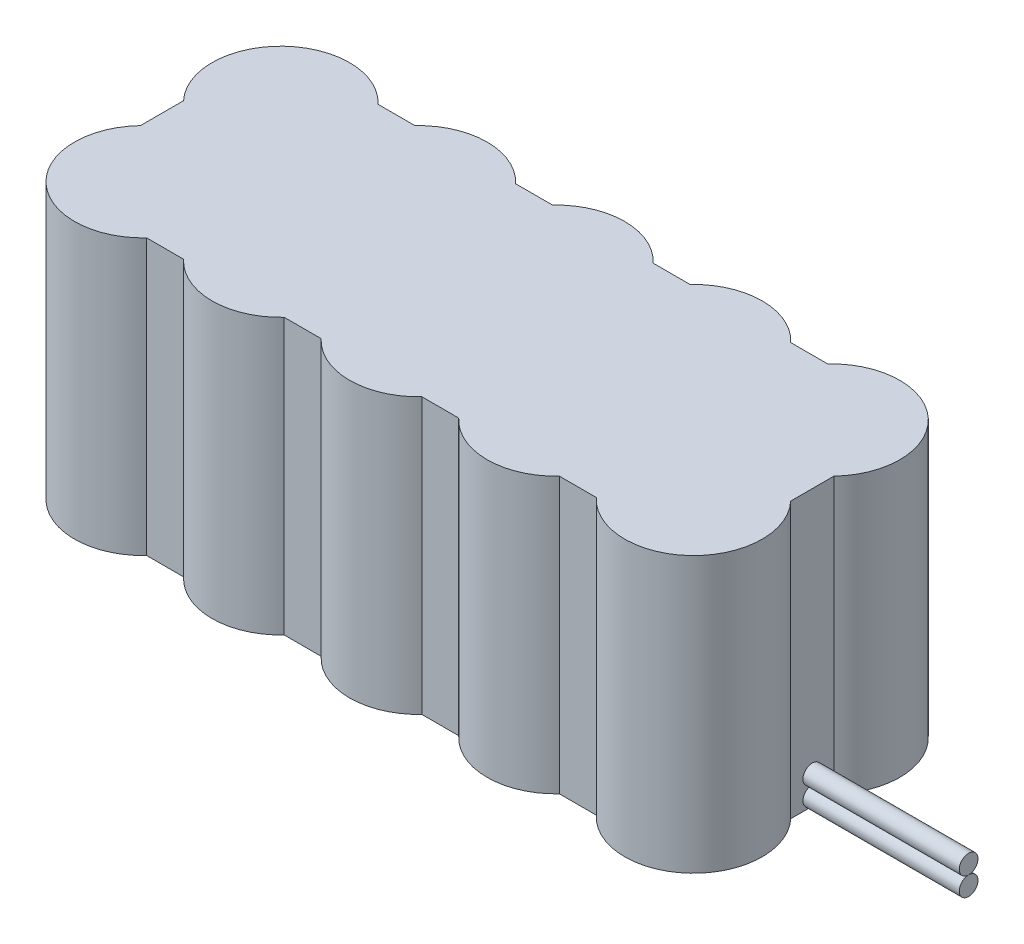
ISO-10303-21;
HEADER;
FILE_DESCRIPTION(('STEP AP214'),'2;1');
FILE_NAME('part.step','',(''),(''),'','','');
FILE_SCHEMA(('AUTOMOTIVE_DESIGN { 1 0 10303 214 1 1 1 1 }'));
ENDSEC;
DATA;
#1=APPLICATION_CONTEXT('core data for automotive mechanical design processes');
#2=APPLICATION_PROTOCOL_DEFINITION('international standard','automotive_design',2000,#1);
#3=PRODUCT_CONTEXT('',#1,'mechanical');
#4=PRODUCT('Part','Part','',(#3));
#5=PRODUCT_RELATED_PRODUCT_CATEGORY('part','',(#4));
#6=PRODUCT_DEFINITION_FORMATION('','',#4);
#7=PRODUCT_DEFINITION_CONTEXT('part definition',#1,'design');
#8=PRODUCT_DEFINITION('design','',#6,#7);
#9=PRODUCT_DEFINITION_SHAPE('','',#8);
#10=(LENGTH_UNIT() NAMED_UNIT(*) SI_UNIT(.MILLI.,.METRE.));
#11=(NAMED_UNIT(*) PLANE_ANGLE_UNIT() SI_UNIT($,.RADIAN.));
#12=(NAMED_UNIT(*) SI_UNIT($,.STERADIAN.) SOLID_ANGLE_UNIT());
#13=UNCERTAINTY_MEASURE_WITH_UNIT(LENGTH_MEASURE(1.E-05),#10,'distance_accuracy_value','');
#14=(GEOMETRIC_REPRESENTATION_CONTEXT(3) GLOBAL_UNCERTAINTY_ASSIGNED_CONTEXT((#13)) GLOBAL_UNIT_ASSIGNED_CONTEXT((#10,
#11,#12)) REPRESENTATION_CONTEXT('',''));
#15=CARTESIAN_POINT('',(0.,0.,0.));
#16=DIRECTION('',(0.,0.,1.));
#17=DIRECTION('',(1.,0.,0.));
#18=AXIS2_PLACEMENT_3D('',#15,#16,#17);
#19=CARTESIAN_POINT('',(96.,4.5,0.));
#20=DIRECTION('',(1.,0.,0.));
#21=DIRECTION('',(0.,0.,-1.));
#22=AXIS2_PLACEMENT_3D('',#19,#20,#21);
#23=CYLINDRICAL_SURFACE('',#22,1.5);
#24=CARTESIAN_POINT('',(121.,4.5,0.));
#25=DIRECTION('',(1.,0.,0.));
#26=DIRECTION('',(0.,0.,-1.));
#27=AXIS2_PLACEMENT_3D('',#24,#25,#26);
#28=CIRCLE('',#27,1.5);
#29=CARTESIAN_POINT('',(121.,4.5,-1.5));
#30=VERTEX_POINT('',#29);
#31=EDGE_CURVE('E100',#30,#30,#28,.F.);
#32=ORIENTED_EDGE('',*,*,#31,.T.);
#33=EDGE_LOOP('',(#32));
#34=FACE_BOUND('',#33,.T.);
#35=CARTESIAN_POINT('',(96.,4.5,0.));
#36=DIRECTION('',(1.,0.,0.));
#37=DIRECTION('',(0.,0.,-1.));
#38=AXIS2_PLACEMENT_3D('',#35,#36,#37);
#39=CIRCLE('',#38,1.5);
#40=CARTESIAN_POINT('',(96.,3.,0.));
#41=VERTEX_POINT('',#40);
#42=EDGE_CURVE('E47',#41,#41,#39,.T.);
#43=ORIENTED_EDGE('',*,*,#42,.T.);
#44=EDGE_LOOP('',(#43));
#45=FACE_BOUND('',#44,.T.);
#46=ADVANCED_FACE('F15',(#34,#45),#23,.T.);
#47=CARTESIAN_POINT('',(121.,0.,0.));
#48=DIRECTION('',(1.,0.,0.));
#49=DIRECTION('',(0.,0.,-1.));
#50=AXIS2_PLACEMENT_3D('',#47,#48,#49);
#51=PLANE('',#50);
#52=ORIENTED_EDGE('',*,*,#31,.F.);
#53=EDGE_LOOP('',(#52));
#54=FACE_BOUND('',#53,.T.);
#55=ADVANCED_FACE('F17',(#54),#51,.T.);
#56=CARTESIAN_POINT('',(96.,1.5,0.));
#57=DIRECTION('',(1.,0.,0.));
#58=DIRECTION('',(0.,0.,-1.));
#59=AXIS2_PLACEMENT_3D('',#56,#57,#58);
#60=CYLINDRICAL_SURFACE('',#59,1.5);
#61=CARTESIAN_POINT('',(121.,1.5,0.));
#62=DIRECTION('',(1.,0.,0.));
#63=DIRECTION('',(0.,0.,-1.));
#64=AXIS2_PLACEMENT_3D('',#61,#62,#63);
#65=CIRCLE('',#64,1.5);
#66=CARTESIAN_POINT('',(121.,1.5,-1.5));
#67=VERTEX_POINT('',#66);
#68=EDGE_CURVE('E95',#67,#67,#65,.F.);
#69=ORIENTED_EDGE('',*,*,#68,.T.);
#70=EDGE_LOOP('',(#69));
#71=FACE_BOUND('',#70,.T.);
#72=CARTESIAN_POINT('',(96.,1.5,0.));
#73=DIRECTION('',(1.,0.,0.));
#74=DIRECTION('',(0.,0.,-1.));
#75=AXIS2_PLACEMENT_3D('',#72,#73,#74);
#76=CIRCLE('',#75,1.5);
#77=CARTESIAN_POINT('',(96.,0.,0.));
#78=VERTEX_POINT('',#77);
#79=EDGE_CURVE('E53',#41,#78,#76,.T.);
#80=ORIENTED_EDGE('',*,*,#79,.T.);
#81=CARTESIAN_POINT('',(96.,1.5,0.));
#82=DIRECTION('',(1.,0.,0.));
#83=DIRECTION('',(0.,0.,-1.));
#84=AXIS2_PLACEMENT_3D('',#81,#82,#83);
#85=CIRCLE('',#84,1.5);
#86=EDGE_CURVE('E57',#78,#41,#85,.T.);
#87=ORIENTED_EDGE('',*,*,#86,.T.);
#88=EDGE_LOOP('',(#80,#87));
#89=FACE_BOUND('',#88,.T.);
#90=ADVANCED_FACE('F55',(#71,#89),#60,.T.);
#91=CARTESIAN_POINT('',(121.,0.,0.));
#92=DIRECTION('',(1.,0.,0.));
#93=DIRECTION('',(0.,0.,-1.));
#94=AXIS2_PLACEMENT_3D('',#91,#92,#93);
#95=PLANE('',#94);
#96=ORIENTED_EDGE('',*,*,#68,.F.);
#97=EDGE_LOOP('',(#96));
#98=FACE_BOUND('',#97,.T.);
#99=ADVANCED_FACE('F119',(#98),#95,.T.);
#100=CARTESIAN_POINT('',(0.,44.,0.));
#101=DIRECTION('',(0.,1.,0.));
#102=DIRECTION('',(0.,0.,1.));
#103=AXIS2_PLACEMENT_3D('',#100,#101,#102);
#104=PLANE('',#103);
#105=CARTESIAN_POINT('',(88.,44.,-11.));
#106=DIRECTION('',(0.,1.,0.));
#107=DIRECTION('',(0.,0.,1.));
#108=AXIS2_PLACEMENT_3D('',#105,#106,#107);
#109=CIRCLE('',#108,11.);
#110=CARTESIAN_POINT('',(96.,44.,-3.45016556472917));
#111=VERTEX_POINT('',#110);
#112=CARTESIAN_POINT('',(79.9532615302822,44.,-18.5));
#113=VERTEX_POINT('',#112);
#114=EDGE_CURVE('E88',#111,#113,#109,.T.);
#115=ORIENTED_EDGE('',*,*,#114,.T.);
#116=DIRECTION('',(1.,0.,0.));
#117=VECTOR('',#116,1.);
#118=CARTESIAN_POINT('',(0.,44.,-18.5));
#119=LINE('',#118,#117);
#120=CARTESIAN_POINT('',(74.0467384697178,44.,-18.5));
#121=VERTEX_POINT('',#120);
#122=EDGE_CURVE('E94',#113,#121,#119,.F.);
#123=ORIENTED_EDGE('',*,*,#122,.T.);
#124=CARTESIAN_POINT('',(66.,44.,-11.));
#125=DIRECTION('',(0.,1.,0.));
#126=DIRECTION('',(0.,0.,1.));
#127=AXIS2_PLACEMENT_3D('',#124,#125,#126);
#128=CIRCLE('',#127,11.);
#129=CARTESIAN_POINT('',(57.9532615302822,44.,-18.5));
#130=VERTEX_POINT('',#129);
#131=EDGE_CURVE('E97',#121,#130,#128,.T.);
#132=ORIENTED_EDGE('',*,*,#131,.T.);
#133=DIRECTION('',(1.,0.,0.));
#134=VECTOR('',#133,1.);
#135=CARTESIAN_POINT('',(0.,44.,-18.5));
#136=LINE('',#135,#134);
#137=CARTESIAN_POINT('',(52.0467384697166,44.,-18.4999999999989));
#138=VERTEX_POINT('',#137);
#139=EDGE_CURVE('E326',#130,#138,#136,.F.);
#140=ORIENTED_EDGE('',*,*,#139,.T.);
#141=CARTESIAN_POINT('',(44.,44.,-11.));
#142=DIRECTION('',(0.,1.,0.));
#143=DIRECTION('',(0.,0.,1.));
#144=AXIS2_PLACEMENT_3D('',#141,#142,#143);
#145=CIRCLE('',#144,11.);
#146=CARTESIAN_POINT('',(35.9532615302822,44.,-18.5));
#147=VERTEX_POINT('',#146);
#148=EDGE_CURVE('E464',#138,#147,#145,.T.);
#149=ORIENTED_EDGE('',*,*,#148,.T.);
#150=DIRECTION('',(1.,0.,0.));
#151=VECTOR('',#150,1.);
#152=CARTESIAN_POINT('',(0.,44.,-18.5));
#153=LINE('',#152,#151);
#154=CARTESIAN_POINT('',(30.0467384697166,44.,-18.4999999999989));
#155=VERTEX_POINT('',#154);
#156=EDGE_CURVE('E461',#147,#155,#153,.F.);
#157=ORIENTED_EDGE('',*,*,#156,.T.);
#158=CARTESIAN_POINT('',(22.,44.,-11.));
#159=DIRECTION('',(0.,1.,0.));
#160=DIRECTION('',(0.,0.,1.));
#161=AXIS2_PLACEMENT_3D('',#158,#159,#160);
#162=CIRCLE('',#161,11.);
#163=CARTESIAN_POINT('',(13.9532615302822,44.,-18.5));
#164=VERTEX_POINT('',#163);
#165=EDGE_CURVE('E458',#155,#164,#162,.T.);
#166=ORIENTED_EDGE('',*,*,#165,.T.);
#167=DIRECTION('',(1.,0.,0.));
#168=VECTOR('',#167,1.);
#169=CARTESIAN_POINT('',(0.,44.,-18.5));
#170=LINE('',#169,#168);
#171=CARTESIAN_POINT('',(8.04673846971565,44.,-18.4999999999999));
#172=VERTEX_POINT('',#171);
#173=EDGE_CURVE('E455',#164,#172,#170,.F.);
#174=ORIENTED_EDGE('',*,*,#173,.T.);
#175=CARTESIAN_POINT('',(0.,44.,-11.));
#176=DIRECTION('',(0.,1.,0.));
#177=DIRECTION('',(0.,0.,1.));
#178=AXIS2_PLACEMENT_3D('',#175,#176,#177);
#179=CIRCLE('',#178,11.);
#180=CARTESIAN_POINT('',(-8.,44.,-3.45016556472913));
#181=VERTEX_POINT('',#180);
#182=EDGE_CURVE('E452',#172,#181,#179,.T.);
#183=ORIENTED_EDGE('',*,*,#182,.T.);
#184=DIRECTION('',(0.,0.,1.));
#185=VECTOR('',#184,1.);
#186=CARTESIAN_POINT('',(-8.,44.,0.));
#187=LINE('',#186,#185);
#188=CARTESIAN_POINT('',(-7.99999999999994,44.,3.45016556472918));
#189=VERTEX_POINT('',#188);
#190=EDGE_CURVE('E449',#181,#189,#187,.T.);
#191=ORIENTED_EDGE('',*,*,#190,.T.);
#192=CARTESIAN_POINT('',(0.,44.,11.));
#193=DIRECTION('',(0.,1.,0.));
#194=DIRECTION('',(0.,0.,1.));
#195=AXIS2_PLACEMENT_3D('',#192,#193,#194);
#196=CIRCLE('',#195,11.);
#197=CARTESIAN_POINT('',(8.04673846971577,44.,18.5));
#198=VERTEX_POINT('',#197);
#199=EDGE_CURVE('E446',#189,#198,#196,.T.);
#200=ORIENTED_EDGE('',*,*,#199,.T.);
#201=DIRECTION('',(1.,0.,0.));
#202=VECTOR('',#201,1.);
#203=CARTESIAN_POINT('',(0.,44.,18.5));
#204=LINE('',#203,#202);
#205=CARTESIAN_POINT('',(13.9532615302834,44.,18.4999999999989));
#206=VERTEX_POINT('',#205);
#207=EDGE_CURVE('E443',#198,#206,#204,.T.);
#208=ORIENTED_EDGE('',*,*,#207,.T.);
#209=CARTESIAN_POINT('',(22.,44.,11.));
#210=DIRECTION('',(0.,1.,0.));
#211=DIRECTION('',(0.,0.,1.));
#212=AXIS2_PLACEMENT_3D('',#209,#210,#211);
#213=CIRCLE('',#212,11.);
#214=CARTESIAN_POINT('',(30.0467384697178,44.,18.5));
#215=VERTEX_POINT('',#214);
#216=EDGE_CURVE('E440',#206,#215,#213,.T.);
#217=ORIENTED_EDGE('',*,*,#216,.T.);
#218=DIRECTION('',(1.,0.,0.));
#219=VECTOR('',#218,1.);
#220=CARTESIAN_POINT('',(0.,44.,18.5));
#221=LINE('',#220,#219);
#222=CARTESIAN_POINT('',(35.9532615302834,44.,18.4999999999989));
#223=VERTEX_POINT('',#222);
#224=EDGE_CURVE('E437',#215,#223,#221,.T.);
#225=ORIENTED_EDGE('',*,*,#224,.T.);
#226=CARTESIAN_POINT('',(44.,44.,11.));
#227=DIRECTION('',(0.,1.,0.));
#228=DIRECTION('',(0.,0.,1.));
#229=AXIS2_PLACEMENT_3D('',#226,#227,#228);
#230=CIRCLE('',#229,11.);
#231=CARTESIAN_POINT('',(52.0467384697178,44.,18.5));
#232=VERTEX_POINT('',#231);
#233=EDGE_CURVE('E434',#223,#232,#230,.T.);
#234=ORIENTED_EDGE('',*,*,#233,.T.);
#235=DIRECTION('',(1.,0.,0.));
#236=VECTOR('',#235,1.);
#237=CARTESIAN_POINT('',(0.,44.,18.5));
#238=LINE('',#237,#236);
#239=CARTESIAN_POINT('',(57.9532615302834,44.,18.4999999999989));
#240=VERTEX_POINT('',#239);
#241=EDGE_CURVE('E431',#232,#240,#238,.T.);
#242=ORIENTED_EDGE('',*,*,#241,.T.);
#243=CARTESIAN_POINT('',(66.,44.,11.));
#244=DIRECTION('',(0.,1.,0.));
#245=DIRECTION('',(0.,0.,1.));
#246=AXIS2_PLACEMENT_3D('',#243,#244,#245);
#247=CIRCLE('',#246,11.);
#248=CARTESIAN_POINT('',(74.0467384697178,44.,18.5));
#249=VERTEX_POINT('',#248);
#250=EDGE_CURVE('E428',#240,#249,#247,.T.);
#251=ORIENTED_EDGE('',*,*,#250,.T.);
#252=DIRECTION('',(1.,0.,0.));
#253=VECTOR('',#252,1.);
#254=CARTESIAN_POINT('',(0.,44.,18.5));
#255=LINE('',#254,#253);
#256=CARTESIAN_POINT('',(79.9532615302834,44.,18.4999999999989));
#257=VERTEX_POINT('',#256);
#258=EDGE_CURVE('E108',#249,#257,#255,.T.);
#259=ORIENTED_EDGE('',*,*,#258,.T.);
#260=CARTESIAN_POINT('',(88.,44.,11.));
#261=DIRECTION('',(0.,1.,0.));
#262=DIRECTION('',(0.,0.,1.));
#263=AXIS2_PLACEMENT_3D('',#260,#261,#262);
#264=CIRCLE('',#263,11.);
#265=CARTESIAN_POINT('',(96.,43.9999998333333,3.45016556472917));
#266=VERTEX_POINT('',#265);
#267=EDGE_CURVE('E106',#257,#266,#264,.T.);
#268=ORIENTED_EDGE('',*,*,#267,.T.);
#269=DIRECTION('',(0.,0.,1.));
#270=VECTOR('',#269,1.);
#271=CARTESIAN_POINT('',(96.,44.,0.));
#272=LINE('',#271,#270);
#273=EDGE_CURVE('E9',#111,#266,#272,.T.);
#274=ORIENTED_EDGE('',*,*,#273,.F.);
#275=EDGE_LOOP('',(#115,#123,#132,#140,#149,#157,#166,#174,#183,#191,#200,#208,#217,#225,#234,
#242,#251,#259,#268,#274));
#276=FACE_BOUND('',#275,.T.);
#277=ADVANCED_FACE('F132',(#276),#104,.T.);
#278=CARTESIAN_POINT('',(88.,0.,-11.));
#279=DIRECTION('',(0.,1.,0.));
#280=DIRECTION('',(0.,0.,1.));
#281=AXIS2_PLACEMENT_3D('',#278,#279,#280);
#282=CYLINDRICAL_SURFACE('',#281,11.);
#283=DIRECTION('',(0.,1.,0.));
#284=VECTOR('',#283,1.);
#285=CARTESIAN_POINT('',(96.,22.,-3.45016556472912));
#286=LINE('',#285,#284);
#287=CARTESIAN_POINT('',(96.,0.,-3.45016556472917));
#288=VERTEX_POINT('',#287);
#289=EDGE_CURVE('E25',#288,#111,#286,.T.);
#290=ORIENTED_EDGE('',*,*,#289,.F.);
#291=CARTESIAN_POINT('',(88.,0.,-11.));
#292=DIRECTION('',(0.,1.,0.));
#293=DIRECTION('',(0.,0.,1.));
#294=AXIS2_PLACEMENT_3D('',#291,#292,#293);
#295=CIRCLE('',#294,11.);
#296=CARTESIAN_POINT('',(79.9532615302822,0.,-18.5));
#297=VERTEX_POINT('',#296);
#298=EDGE_CURVE('E71',#288,#297,#295,.T.);
#299=ORIENTED_EDGE('',*,*,#298,.T.);
#300=DIRECTION('',(0.,1.,0.));
#301=VECTOR('',#300,1.);
#302=CARTESIAN_POINT('',(79.95326153028,0.,-18.5));
#303=LINE('',#302,#301);
#304=EDGE_CURVE('E90',#113,#297,#303,.F.);
#305=ORIENTED_EDGE('',*,*,#304,.F.);
#306=ORIENTED_EDGE('',*,*,#114,.F.);
#307=EDGE_LOOP('',(#290,#299,#305,#306));
#308=FACE_BOUND('',#307,.T.);
#309=ADVANCED_FACE('F83',(#308),#282,.T.);
#310=CARTESIAN_POINT('',(88.,0.,11.));
#311=DIRECTION('',(0.,1.,0.));
#312=DIRECTION('',(0.,0.,1.));
#313=AXIS2_PLACEMENT_3D('',#310,#311,#312);
#314=CYLINDRICAL_SURFACE('',#313,11.);
#315=DIRECTION('',(0.,1.,0.));
#316=VECTOR('',#315,1.);
#317=CARTESIAN_POINT('',(79.9532615302824,0.,18.4999999999978));
#318=LINE('',#317,#316);
#319=CARTESIAN_POINT('',(79.9532615302834,0.,18.4999999999989));
#320=VERTEX_POINT('',#319);
#321=EDGE_CURVE('E422',#257,#320,#318,.F.);
#322=ORIENTED_EDGE('',*,*,#321,.T.);
#323=CARTESIAN_POINT('',(88.,0.,11.));
#324=DIRECTION('',(0.,1.,0.));
#325=DIRECTION('',(0.,0.,1.));
#326=AXIS2_PLACEMENT_3D('',#323,#324,#325);
#327=CIRCLE('',#326,11.);
#328=CARTESIAN_POINT('',(96.,0.,3.45016556472917));
#329=VERTEX_POINT('',#328);
#330=EDGE_CURVE('E78',#320,#329,#327,.T.);
#331=ORIENTED_EDGE('',*,*,#330,.T.);
#332=DIRECTION('',(0.,1.,0.));
#333=VECTOR('',#332,1.);
#334=CARTESIAN_POINT('',(96.,22.,3.45016556472912));
#335=LINE('',#334,#333);
#336=EDGE_CURVE('E19',#329,#266,#335,.T.);
#337=ORIENTED_EDGE('',*,*,#336,.T.);
#338=ORIENTED_EDGE('',*,*,#267,.F.);
#339=EDGE_LOOP('',(#322,#331,#337,#338));
#340=FACE_BOUND('',#339,.T.);
#341=ADVANCED_FACE('F137',(#340),#314,.T.);
#342=CARTESIAN_POINT('',(0.,0.,0.));
#343=DIRECTION('',(0.,1.,0.));
#344=DIRECTION('',(0.,0.,1.));
#345=AXIS2_PLACEMENT_3D('',#342,#343,#344);
#346=PLANE('',#345);
#347=DIRECTION('',(1.,0.,0.));
#348=VECTOR('',#347,1.);
#349=CARTESIAN_POINT('',(-8.,0.,18.5));
#350=LINE('',#349,#348);
#351=CARTESIAN_POINT('',(74.0467384697178,0.,18.5));
#352=VERTEX_POINT('',#351);
#353=EDGE_CURVE('E419',#352,#320,#350,.T.);
#354=ORIENTED_EDGE('',*,*,#353,.F.);
#355=CARTESIAN_POINT('',(66.,0.,11.));
#356=DIRECTION('',(0.,1.,0.));
#357=DIRECTION('',(0.,0.,1.));
#358=AXIS2_PLACEMENT_3D('',#355,#356,#357);
#359=CIRCLE('',#358,11.);
#360=CARTESIAN_POINT('',(57.9532615302834,0.,18.4999999999989));
#361=VERTEX_POINT('',#360);
#362=EDGE_CURVE('E416',#361,#352,#359,.T.);
#363=ORIENTED_EDGE('',*,*,#362,.F.);
#364=DIRECTION('',(1.,0.,0.));
#365=VECTOR('',#364,1.);
#366=CARTESIAN_POINT('',(-8.,0.,18.5));
#367=LINE('',#366,#365);
#368=CARTESIAN_POINT('',(52.0467384697178,0.,18.5));
#369=VERTEX_POINT('',#368);
#370=EDGE_CURVE('E413',#369,#361,#367,.T.);
#371=ORIENTED_EDGE('',*,*,#370,.F.);
#372=CARTESIAN_POINT('',(44.,0.,11.));
#373=DIRECTION('',(0.,1.,0.));
#374=DIRECTION('',(0.,0.,1.));
#375=AXIS2_PLACEMENT_3D('',#372,#373,#374);
#376=CIRCLE('',#375,11.);
#377=CARTESIAN_POINT('',(35.9532615302834,0.,18.4999999999989));
#378=VERTEX_POINT('',#377);
#379=EDGE_CURVE('E410',#378,#369,#376,.T.);
#380=ORIENTED_EDGE('',*,*,#379,.F.);
#381=DIRECTION('',(1.,0.,0.));
#382=VECTOR('',#381,1.);
#383=CARTESIAN_POINT('',(-8.,0.,18.5));
#384=LINE('',#383,#382);
#385=CARTESIAN_POINT('',(30.0467384697178,0.,18.5));
#386=VERTEX_POINT('',#385);
#387=EDGE_CURVE('E407',#386,#378,#384,.T.);
#388=ORIENTED_EDGE('',*,*,#387,.F.);
#389=CARTESIAN_POINT('',(22.,0.,11.));
#390=DIRECTION('',(0.,1.,0.));
#391=DIRECTION('',(0.,0.,1.));
#392=AXIS2_PLACEMENT_3D('',#389,#390,#391);
#393=CIRCLE('',#392,11.);
#394=CARTESIAN_POINT('',(13.9532615302834,0.,18.4999999999989));
#395=VERTEX_POINT('',#394);
#396=EDGE_CURVE('E404',#395,#386,#393,.T.);
#397=ORIENTED_EDGE('',*,*,#396,.F.);
#398=DIRECTION('',(1.,0.,0.));
#399=VECTOR('',#398,1.);
#400=CARTESIAN_POINT('',(-8.,0.,18.5));
#401=LINE('',#400,#399);
#402=CARTESIAN_POINT('',(8.04673846971577,0.,18.5));
#403=VERTEX_POINT('',#402);
#404=EDGE_CURVE('E401',#403,#395,#401,.T.);
#405=ORIENTED_EDGE('',*,*,#404,.F.);
#406=CARTESIAN_POINT('',(0.,0.,11.));
#407=DIRECTION('',(0.,1.,0.));
#408=DIRECTION('',(0.,0.,1.));
#409=AXIS2_PLACEMENT_3D('',#406,#407,#408);
#410=CIRCLE('',#409,11.);
#411=CARTESIAN_POINT('',(-7.99999999999994,0.,3.45016556472918));
#412=VERTEX_POINT('',#411);
#413=EDGE_CURVE('E398',#412,#403,#410,.T.);
#414=ORIENTED_EDGE('',*,*,#413,.F.);
#415=DIRECTION('',(0.,0.,1.));
#416=VECTOR('',#415,1.);
#417=CARTESIAN_POINT('',(-8.,0.,-18.5));
#418=LINE('',#417,#416);
#419=CARTESIAN_POINT('',(-8.,0.,-3.45016556472913));
#420=VERTEX_POINT('',#419);
#421=EDGE_CURVE('E395',#420,#412,#418,.T.);
#422=ORIENTED_EDGE('',*,*,#421,.F.);
#423=CARTESIAN_POINT('',(0.,0.,-11.));
#424=DIRECTION('',(0.,1.,0.));
#425=DIRECTION('',(0.,0.,1.));
#426=AXIS2_PLACEMENT_3D('',#423,#424,#425);
#427=CIRCLE('',#426,11.);
#428=CARTESIAN_POINT('',(8.04673846971565,0.,-18.4999999999999));
#429=VERTEX_POINT('',#428);
#430=EDGE_CURVE('E392',#429,#420,#427,.T.);
#431=ORIENTED_EDGE('',*,*,#430,.F.);
#432=DIRECTION('',(-1.,0.,0.));
#433=VECTOR('',#432,1.);
#434=CARTESIAN_POINT('',(96.,0.,-18.5));
#435=LINE('',#434,#433);
#436=CARTESIAN_POINT('',(13.9532615302822,0.,-18.5));
#437=VERTEX_POINT('',#436);
#438=EDGE_CURVE('E389',#437,#429,#435,.T.);
#439=ORIENTED_EDGE('',*,*,#438,.F.);
#440=CARTESIAN_POINT('',(22.,0.,-11.));
#441=DIRECTION('',(0.,1.,0.));
#442=DIRECTION('',(0.,0.,1.));
#443=AXIS2_PLACEMENT_3D('',#440,#441,#442);
#444=CIRCLE('',#443,11.);
#445=CARTESIAN_POINT('',(30.0467384697166,0.,-18.4999999999989));
#446=VERTEX_POINT('',#445);
#447=EDGE_CURVE('E386',#446,#437,#444,.T.);
#448=ORIENTED_EDGE('',*,*,#447,.F.);
#449=DIRECTION('',(-1.,0.,0.));
#450=VECTOR('',#449,1.);
#451=CARTESIAN_POINT('',(96.,0.,-18.5));
#452=LINE('',#451,#450);
#453=CARTESIAN_POINT('',(35.9532615302822,0.,-18.5));
#454=VERTEX_POINT('',#453);
#455=EDGE_CURVE('E383',#454,#446,#452,.T.);
#456=ORIENTED_EDGE('',*,*,#455,.F.);
#457=CARTESIAN_POINT('',(44.,0.,-11.));
#458=DIRECTION('',(0.,1.,0.));
#459=DIRECTION('',(0.,0.,1.));
#460=AXIS2_PLACEMENT_3D('',#457,#458,#459);
#461=CIRCLE('',#460,11.);
#462=CARTESIAN_POINT('',(52.0467384697166,0.,-18.4999999999989));
#463=VERTEX_POINT('',#462);
#464=EDGE_CURVE('E380',#463,#454,#461,.T.);
#465=ORIENTED_EDGE('',*,*,#464,.F.);
#466=DIRECTION('',(-1.,0.,0.));
#467=VECTOR('',#466,1.);
#468=CARTESIAN_POINT('',(96.,0.,-18.5));
#469=LINE('',#468,#467);
#470=CARTESIAN_POINT('',(57.9532615302822,0.,-18.5));
#471=VERTEX_POINT('',#470);
#472=EDGE_CURVE('E378',#471,#463,#469,.T.);
#473=ORIENTED_EDGE('',*,*,#472,.F.);
#474=CARTESIAN_POINT('',(66.,0.,-11.));
#475=DIRECTION('',(0.,1.,0.));
#476=DIRECTION('',(0.,0.,1.));
#477=AXIS2_PLACEMENT_3D('',#474,#475,#476);
#478=CIRCLE('',#477,11.);
#479=CARTESIAN_POINT('',(74.0467384697178,0.,-18.5));
#480=VERTEX_POINT('',#479);
#481=EDGE_CURVE('E376',#480,#471,#478,.T.);
#482=ORIENTED_EDGE('',*,*,#481,.F.);
#483=DIRECTION('',(-1.,0.,0.));
#484=VECTOR('',#483,1.);
#485=CARTESIAN_POINT('',(96.,0.,-18.5));
#486=LINE('',#485,#484);
#487=EDGE_CURVE('E329',#297,#480,#486,.T.);
#488=ORIENTED_EDGE('',*,*,#487,.F.);
#489=ORIENTED_EDGE('',*,*,#298,.F.);
#490=DIRECTION('',(0.,0.,1.));
#491=VECTOR('',#490,1.);
#492=CARTESIAN_POINT('',(96.,0.,-1.7250827823646));
#493=LINE('',#492,#491);
#494=EDGE_CURVE('E65',#288,#78,#493,.T.);
#495=ORIENTED_EDGE('',*,*,#494,.T.);
#496=DIRECTION('',(0.,0.,1.));
#497=VECTOR('',#496,1.);
#498=CARTESIAN_POINT('',(96.,0.,1.7250827823646));
#499=LINE('',#498,#497);
#500=EDGE_CURVE('E60',#78,#329,#499,.T.);
#501=ORIENTED_EDGE('',*,*,#500,.T.);
#502=ORIENTED_EDGE('',*,*,#330,.F.);
#503=EDGE_LOOP('',(#354,#363,#371,#380,#388,#397,#405,#414,#422,#431,#439,#448,#456,#465,#473,
#482,#488,#489,#495,#501,#502));
#504=FACE_BOUND('',#503,.T.);
#505=ADVANCED_FACE('F67',(#504),#346,.F.);
#506=CARTESIAN_POINT('',(-8.,0.,18.5));
#507=DIRECTION('',(0.,0.,1.));
#508=DIRECTION('',(1.,0.,0.));
#509=AXIS2_PLACEMENT_3D('',#506,#507,#508);
#510=PLANE('',#509);
#511=ORIENTED_EDGE('',*,*,#353,.T.);
#512=ORIENTED_EDGE('',*,*,#321,.F.);
#513=ORIENTED_EDGE('',*,*,#258,.F.);
#514=DIRECTION('',(0.,1.,0.));
#515=VECTOR('',#514,1.);
#516=CARTESIAN_POINT('',(74.04673846972,0.,18.5));
#517=LINE('',#516,#515);
#518=EDGE_CURVE('E372',#249,#352,#517,.F.);
#519=ORIENTED_EDGE('',*,*,#518,.T.);
#520=EDGE_LOOP('',(#511,#512,#513,#519));
#521=FACE_BOUND('',#520,.T.);
#522=ADVANCED_FACE('F142',(#521),#510,.T.);
#523=CARTESIAN_POINT('',(66.,0.,11.));
#524=DIRECTION('',(0.,1.,0.));
#525=DIRECTION('',(0.,0.,1.));
#526=AXIS2_PLACEMENT_3D('',#523,#524,#525);
#527=CYLINDRICAL_SURFACE('',#526,11.);
#528=ORIENTED_EDGE('',*,*,#250,.F.);
#529=DIRECTION('',(0.,1.,0.));
#530=VECTOR('',#529,1.);
#531=CARTESIAN_POINT('',(57.9532615302824,0.,18.4999999999978));
#532=LINE('',#531,#530);
#533=EDGE_CURVE('E369',#240,#361,#532,.F.);
#534=ORIENTED_EDGE('',*,*,#533,.T.);
#535=ORIENTED_EDGE('',*,*,#362,.T.);
#536=ORIENTED_EDGE('',*,*,#518,.F.);
#537=EDGE_LOOP('',(#528,#534,#535,#536));
#538=FACE_BOUND('',#537,.T.);
#539=ADVANCED_FACE('F145',(#538),#527,.T.);
#540=CARTESIAN_POINT('',(-8.,0.,18.5));
#541=DIRECTION('',(0.,0.,1.));
#542=DIRECTION('',(1.,0.,0.));
#543=AXIS2_PLACEMENT_3D('',#540,#541,#542);
#544=PLANE('',#543);
#545=ORIENTED_EDGE('',*,*,#370,.T.);
#546=ORIENTED_EDGE('',*,*,#533,.F.);
#547=ORIENTED_EDGE('',*,*,#241,.F.);
#548=DIRECTION('',(0.,1.,0.));
#549=VECTOR('',#548,1.);
#550=CARTESIAN_POINT('',(52.04673846972,0.,18.5));
#551=LINE('',#550,#549);
#552=EDGE_CURVE('E366',#232,#369,#551,.F.);
#553=ORIENTED_EDGE('',*,*,#552,.T.);
#554=EDGE_LOOP('',(#545,#546,#547,#553));
#555=FACE_BOUND('',#554,.T.);
#556=ADVANCED_FACE('F149',(#555),#544,.T.);
#557=CARTESIAN_POINT('',(44.,0.,11.));
#558=DIRECTION('',(0.,1.,0.));
#559=DIRECTION('',(0.,0.,1.));
#560=AXIS2_PLACEMENT_3D('',#557,#558,#559);
#561=CYLINDRICAL_SURFACE('',#560,11.);
#562=ORIENTED_EDGE('',*,*,#233,.F.);
#563=DIRECTION('',(0.,1.,0.));
#564=VECTOR('',#563,1.);
#565=CARTESIAN_POINT('',(35.9532615302824,0.,18.4999999999978));
#566=LINE('',#565,#564);
#567=EDGE_CURVE('E363',#223,#378,#566,.F.);
#568=ORIENTED_EDGE('',*,*,#567,.T.);
#569=ORIENTED_EDGE('',*,*,#379,.T.);
#570=ORIENTED_EDGE('',*,*,#552,.F.);
#571=EDGE_LOOP('',(#562,#568,#569,#570));
#572=FACE_BOUND('',#571,.T.);
#573=ADVANCED_FACE('F153',(#572),#561,.T.);
#574=CARTESIAN_POINT('',(-8.,0.,18.5));
#575=DIRECTION('',(0.,0.,1.));
#576=DIRECTION('',(1.,0.,0.));
#577=AXIS2_PLACEMENT_3D('',#574,#575,#576);
#578=PLANE('',#577);
#579=ORIENTED_EDGE('',*,*,#387,.T.);
#580=ORIENTED_EDGE('',*,*,#567,.F.);
#581=ORIENTED_EDGE('',*,*,#224,.F.);
#582=DIRECTION('',(0.,1.,0.));
#583=VECTOR('',#582,1.);
#584=CARTESIAN_POINT('',(30.04673846972,0.,18.5));
#585=LINE('',#584,#583);
#586=EDGE_CURVE('E360',#215,#386,#585,.F.);
#587=ORIENTED_EDGE('',*,*,#586,.T.);
#588=EDGE_LOOP('',(#579,#580,#581,#587));
#589=FACE_BOUND('',#588,.T.);
#590=ADVANCED_FACE('F157',(#589),#578,.T.);
#591=CARTESIAN_POINT('',(22.,0.,11.));
#592=DIRECTION('',(0.,1.,0.));
#593=DIRECTION('',(0.,0.,1.));
#594=AXIS2_PLACEMENT_3D('',#591,#592,#593);
#595=CYLINDRICAL_SURFACE('',#594,11.);
#596=ORIENTED_EDGE('',*,*,#216,.F.);
#597=DIRECTION('',(0.,1.,0.));
#598=VECTOR('',#597,1.);
#599=CARTESIAN_POINT('',(13.9532615302824,0.,18.4999999999978));
#600=LINE('',#599,#598);
#601=EDGE_CURVE('E357',#206,#395,#600,.F.);
#602=ORIENTED_EDGE('',*,*,#601,.T.);
#603=ORIENTED_EDGE('',*,*,#396,.T.);
#604=ORIENTED_EDGE('',*,*,#586,.F.);
#605=EDGE_LOOP('',(#596,#602,#603,#604));
#606=FACE_BOUND('',#605,.T.);
#607=ADVANCED_FACE('F161',(#606),#595,.T.);
#608=CARTESIAN_POINT('',(-8.,0.,18.5));
#609=DIRECTION('',(0.,0.,1.));
#610=DIRECTION('',(1.,0.,0.));
#611=AXIS2_PLACEMENT_3D('',#608,#609,#610);
#612=PLANE('',#611);
#613=ORIENTED_EDGE('',*,*,#404,.T.);
#614=ORIENTED_EDGE('',*,*,#601,.F.);
#615=ORIENTED_EDGE('',*,*,#207,.F.);
#616=DIRECTION('',(0.,1.,0.));
#617=VECTOR('',#616,1.);
#618=CARTESIAN_POINT('',(8.046738469716,0.,18.5));
#619=LINE('',#618,#617);
#620=EDGE_CURVE('E354',#198,#403,#619,.F.);
#621=ORIENTED_EDGE('',*,*,#620,.T.);
#622=EDGE_LOOP('',(#613,#614,#615,#621));
#623=FACE_BOUND('',#622,.T.);
#624=ADVANCED_FACE('F165',(#623),#612,.T.);
#625=CARTESIAN_POINT('',(0.,0.,11.));
#626=DIRECTION('',(0.,1.,0.));
#627=DIRECTION('',(0.,0.,1.));
#628=AXIS2_PLACEMENT_3D('',#625,#626,#627);
#629=CYLINDRICAL_SURFACE('',#628,11.);
#630=ORIENTED_EDGE('',*,*,#620,.F.);
#631=ORIENTED_EDGE('',*,*,#199,.F.);
#632=DIRECTION('',(0.,1.,0.));
#633=VECTOR('',#632,1.);
#634=CARTESIAN_POINT('',(-7.99999999999987,0.,3.45016556472912));
#635=LINE('',#634,#633);
#636=EDGE_CURVE('E351',#189,#412,#635,.F.);
#637=ORIENTED_EDGE('',*,*,#636,.T.);
#638=ORIENTED_EDGE('',*,*,#413,.T.);
#639=EDGE_LOOP('',(#630,#631,#637,#638));
#640=FACE_BOUND('',#639,.T.);
#641=ADVANCED_FACE('F169',(#640),#629,.T.);
#642=CARTESIAN_POINT('',(-8.,0.,-18.5));
#643=DIRECTION('',(-1.,0.,0.));
#644=DIRECTION('',(0.,0.,1.));
#645=AXIS2_PLACEMENT_3D('',#642,#643,#644);
#646=PLANE('',#645);
#647=ORIENTED_EDGE('',*,*,#190,.F.);
#648=DIRECTION('',(0.,1.,0.));
#649=VECTOR('',#648,1.);
#650=CARTESIAN_POINT('',(-8.,0.,-3.450165564729));
#651=LINE('',#650,#649);
#652=EDGE_CURVE('E348',#181,#420,#651,.F.);
#653=ORIENTED_EDGE('',*,*,#652,.T.);
#654=ORIENTED_EDGE('',*,*,#421,.T.);
#655=ORIENTED_EDGE('',*,*,#636,.F.);
#656=EDGE_LOOP('',(#647,#653,#654,#655));
#657=FACE_BOUND('',#656,.T.);
#658=ADVANCED_FACE('F173',(#657),#646,.T.);
#659=CARTESIAN_POINT('',(0.,0.,-11.));
#660=DIRECTION('',(0.,1.,0.));
#661=DIRECTION('',(0.,0.,1.));
#662=AXIS2_PLACEMENT_3D('',#659,#660,#661);
#663=CYLINDRICAL_SURFACE('',#662,11.);
#664=ORIENTED_EDGE('',*,*,#652,.F.);
#665=ORIENTED_EDGE('',*,*,#182,.F.);
#666=DIRECTION('',(0.,1.,0.));
#667=VECTOR('',#666,1.);
#668=CARTESIAN_POINT('',(8.04673846971576,0.,-18.4999999999998));
#669=LINE('',#668,#667);
#670=EDGE_CURVE('E345',#172,#429,#669,.F.);
#671=ORIENTED_EDGE('',*,*,#670,.T.);
#672=ORIENTED_EDGE('',*,*,#430,.T.);
#673=EDGE_LOOP('',(#664,#665,#671,#672));
#674=FACE_BOUND('',#673,.T.);
#675=ADVANCED_FACE('F177',(#674),#663,.T.);
#676=CARTESIAN_POINT('',(96.,0.,-18.5));
#677=DIRECTION('',(0.,0.,-1.));
#678=DIRECTION('',(-1.,0.,0.));
#679=AXIS2_PLACEMENT_3D('',#676,#677,#678);
#680=PLANE('',#679);
#681=ORIENTED_EDGE('',*,*,#173,.F.);
#682=DIRECTION('',(0.,1.,0.));
#683=VECTOR('',#682,1.);
#684=CARTESIAN_POINT('',(13.95326153028,0.,-18.5));
#685=LINE('',#684,#683);
#686=EDGE_CURVE('E342',#164,#437,#685,.F.);
#687=ORIENTED_EDGE('',*,*,#686,.T.);
#688=ORIENTED_EDGE('',*,*,#438,.T.);
#689=ORIENTED_EDGE('',*,*,#670,.F.);
#690=EDGE_LOOP('',(#681,#687,#688,#689));
#691=FACE_BOUND('',#690,.T.);
#692=ADVANCED_FACE('F181',(#691),#680,.T.);
#693=CARTESIAN_POINT('',(22.,0.,-11.));
#694=DIRECTION('',(0.,1.,0.));
#695=DIRECTION('',(0.,0.,1.));
#696=AXIS2_PLACEMENT_3D('',#693,#694,#695);
#697=CYLINDRICAL_SURFACE('',#696,11.);
#698=ORIENTED_EDGE('',*,*,#165,.F.);
#699=DIRECTION('',(0.,1.,0.));
#700=VECTOR('',#699,1.);
#701=CARTESIAN_POINT('',(30.0467384697176,0.,-18.4999999999978));
#702=LINE('',#701,#700);
#703=EDGE_CURVE('E339',#155,#446,#702,.F.);
#704=ORIENTED_EDGE('',*,*,#703,.T.);
#705=ORIENTED_EDGE('',*,*,#447,.T.);
#706=ORIENTED_EDGE('',*,*,#686,.F.);
#707=EDGE_LOOP('',(#698,#704,#705,#706));
#708=FACE_BOUND('',#707,.T.);
#709=ADVANCED_FACE('F185',(#708),#697,.T.);
#710=CARTESIAN_POINT('',(96.,0.,-18.5));
#711=DIRECTION('',(0.,0.,-1.));
#712=DIRECTION('',(-1.,0.,0.));
#713=AXIS2_PLACEMENT_3D('',#710,#711,#712);
#714=PLANE('',#713);
#715=ORIENTED_EDGE('',*,*,#156,.F.);
#716=DIRECTION('',(0.,1.,0.));
#717=VECTOR('',#716,1.);
#718=CARTESIAN_POINT('',(35.95326153028,0.,-18.5));
#719=LINE('',#718,#717);
#720=EDGE_CURVE('E334',#147,#454,#719,.F.);
#721=ORIENTED_EDGE('',*,*,#720,.T.);
#722=ORIENTED_EDGE('',*,*,#455,.T.);
#723=ORIENTED_EDGE('',*,*,#703,.F.);
#724=EDGE_LOOP('',(#715,#721,#722,#723));
#725=FACE_BOUND('',#724,.T.);
#726=ADVANCED_FACE('F189',(#725),#714,.T.);
#727=CARTESIAN_POINT('',(44.,0.,-11.));
#728=DIRECTION('',(0.,1.,0.));
#729=DIRECTION('',(0.,0.,1.));
#730=AXIS2_PLACEMENT_3D('',#727,#728,#729);
#731=CYLINDRICAL_SURFACE('',#730,11.);
#732=ORIENTED_EDGE('',*,*,#148,.F.);
#733=DIRECTION('',(0.,1.,0.));
#734=VECTOR('',#733,1.);
#735=CARTESIAN_POINT('',(52.0467384697176,0.,-18.4999999999978));
#736=LINE('',#735,#734);
#737=EDGE_CURVE('E330',#138,#463,#736,.F.);
#738=ORIENTED_EDGE('',*,*,#737,.T.);
#739=ORIENTED_EDGE('',*,*,#464,.T.);
#740=ORIENTED_EDGE('',*,*,#720,.F.);
#741=EDGE_LOOP('',(#732,#738,#739,#740));
#742=FACE_BOUND('',#741,.T.);
#743=ADVANCED_FACE('F193',(#742),#731,.T.);
#744=CARTESIAN_POINT('',(96.,0.,-18.5));
#745=DIRECTION('',(0.,0.,-1.));
#746=DIRECTION('',(-1.,0.,0.));
#747=AXIS2_PLACEMENT_3D('',#744,#745,#746);
#748=PLANE('',#747);
#749=ORIENTED_EDGE('',*,*,#139,.F.);
#750=DIRECTION('',(0.,1.,0.));
#751=VECTOR('',#750,1.);
#752=CARTESIAN_POINT('',(57.95326153028,0.,-18.5));
#753=LINE('',#752,#751);
#754=EDGE_CURVE('E322',#130,#471,#753,.F.);
#755=ORIENTED_EDGE('',*,*,#754,.T.);
#756=ORIENTED_EDGE('',*,*,#472,.T.);
#757=ORIENTED_EDGE('',*,*,#737,.F.);
#758=EDGE_LOOP('',(#749,#755,#756,#757));
#759=FACE_BOUND('',#758,.T.);
#760=ADVANCED_FACE('F197',(#759),#748,.T.);
#761=CARTESIAN_POINT('',(66.,0.,-11.));
#762=DIRECTION('',(0.,1.,0.));
#763=DIRECTION('',(0.,0.,1.));
#764=AXIS2_PLACEMENT_3D('',#761,#762,#763);
#765=CYLINDRICAL_SURFACE('',#764,11.);
#766=ORIENTED_EDGE('',*,*,#131,.F.);
#767=DIRECTION('',(0.,1.,0.));
#768=VECTOR('',#767,1.);
#769=CARTESIAN_POINT('',(74.04673846972,0.,-18.5));
#770=LINE('',#769,#768);
#771=EDGE_CURVE('E104',#480,#121,#770,.T.);
#772=ORIENTED_EDGE('',*,*,#771,.F.);
#773=ORIENTED_EDGE('',*,*,#481,.T.);
#774=ORIENTED_EDGE('',*,*,#754,.F.);
#775=EDGE_LOOP('',(#766,#772,#773,#774));
#776=FACE_BOUND('',#775,.T.);
#777=ADVANCED_FACE('F128',(#776),#765,.T.);
#778=CARTESIAN_POINT('',(96.,0.,-18.5));
#779=DIRECTION('',(0.,0.,-1.));
#780=DIRECTION('',(-1.,0.,0.));
#781=AXIS2_PLACEMENT_3D('',#778,#779,#780);
#782=PLANE('',#781);
#783=ORIENTED_EDGE('',*,*,#122,.F.);
#784=ORIENTED_EDGE('',*,*,#304,.T.);
#785=ORIENTED_EDGE('',*,*,#487,.T.);
#786=ORIENTED_EDGE('',*,*,#771,.T.);
#787=EDGE_LOOP('',(#783,#784,#785,#786));
#788=FACE_BOUND('',#787,.T.);
#789=ADVANCED_FACE('F123',(#788),#782,.T.);
#790=CARTESIAN_POINT('',(96.,0.,18.5));
#791=DIRECTION('',(1.,0.,0.));
#792=DIRECTION('',(0.,0.,-1.));
#793=AXIS2_PLACEMENT_3D('',#790,#791,#792);
#794=PLANE('',#793);
#795=ORIENTED_EDGE('',*,*,#336,.F.);
#796=ORIENTED_EDGE('',*,*,#500,.F.);
#797=ORIENTED_EDGE('',*,*,#79,.F.);
#798=ORIENTED_EDGE('',*,*,#42,.F.);
#799=ORIENTED_EDGE('',*,*,#86,.F.);
#800=ORIENTED_EDGE('',*,*,#494,.F.);
#801=ORIENTED_EDGE('',*,*,#289,.T.);
#802=ORIENTED_EDGE('',*,*,#273,.T.);
#803=EDGE_LOOP('',(#795,#796,#797,#798,#799,#800,#801,#802));
#804=FACE_BOUND('',#803,.T.);
#805=ADVANCED_FACE('F74',(#804),#794,.T.);
#806=CLOSED_SHELL('',(#46,#55,#90,#99,#277,#309,#341,#505,#522,#539,#556,#573,#590,#607,#624,
#641,#658,#675,#692,#709,#726,#743,#760,#777,#789,#805));
#807=MANIFOLD_SOLID_BREP('B1',#806);
#808=ADVANCED_BREP_SHAPE_REPRESENTATION('',(#18,#807),#14);
#809=SHAPE_DEFINITION_REPRESENTATION(#9,#808);
ENDSEC;
END-ISO-10303-21;
